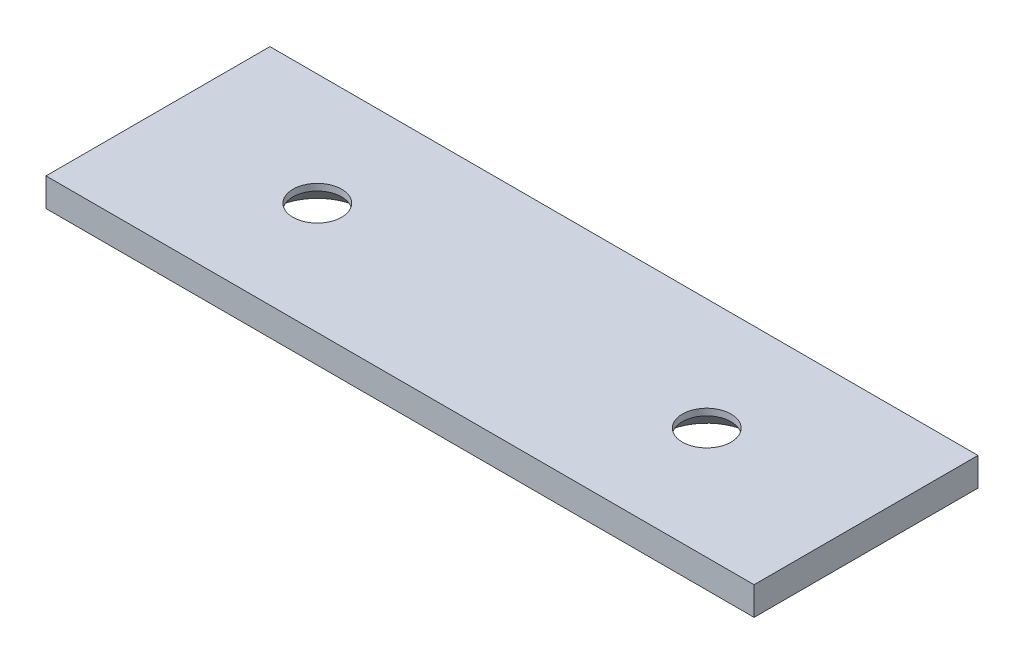
ISO-10303-21;
HEADER;
FILE_DESCRIPTION(('STEP AP214'),'2;1');
FILE_NAME('part.step','',(''),(''),'','','');
FILE_SCHEMA(('AUTOMOTIVE_DESIGN { 1 0 10303 214 1 1 1 1 }'));
ENDSEC;
DATA;
#1=APPLICATION_CONTEXT('core data for automotive mechanical design processes');
#2=APPLICATION_PROTOCOL_DEFINITION('international standard','automotive_design',2000,#1);
#3=PRODUCT_CONTEXT('',#1,'mechanical');
#4=PRODUCT('Part','Part','',(#3));
#5=PRODUCT_RELATED_PRODUCT_CATEGORY('part','',(#4));
#6=PRODUCT_DEFINITION_FORMATION('','',#4);
#7=PRODUCT_DEFINITION_CONTEXT('part definition',#1,'design');
#8=PRODUCT_DEFINITION('design','',#6,#7);
#9=PRODUCT_DEFINITION_SHAPE('','',#8);
#10=(LENGTH_UNIT() NAMED_UNIT(*) SI_UNIT(.MILLI.,.METRE.));
#11=(NAMED_UNIT(*) PLANE_ANGLE_UNIT() SI_UNIT($,.RADIAN.));
#12=(NAMED_UNIT(*) SI_UNIT($,.STERADIAN.) SOLID_ANGLE_UNIT());
#13=UNCERTAINTY_MEASURE_WITH_UNIT(LENGTH_MEASURE(1.E-05),#10,'distance_accuracy_value','');
#14=(GEOMETRIC_REPRESENTATION_CONTEXT(3) GLOBAL_UNCERTAINTY_ASSIGNED_CONTEXT((#13)) GLOBAL_UNIT_ASSIGNED_CONTEXT((#10,
#11,#12)) REPRESENTATION_CONTEXT('',''));
#15=CARTESIAN_POINT('',(0.,0.,0.));
#16=DIRECTION('',(0.,0.,1.));
#17=DIRECTION('',(1.,0.,0.));
#18=AXIS2_PLACEMENT_3D('',#15,#16,#17);
#19=CARTESIAN_POINT('',(0.,3.2,0.));
#20=DIRECTION('',(1.,0.,0.));
#21=DIRECTION('',(0.,0.,-1.));
#22=AXIS2_PLACEMENT_3D('',#19,#20,#21);
#23=PLANE('',#22);
#24=DIRECTION('',(0.,0.,1.));
#25=VECTOR('',#24,1.);
#26=CARTESIAN_POINT('',(0.,0.,0.));
#27=LINE('',#26,#25);
#28=CARTESIAN_POINT('',(0.,0.,0.));
#29=VERTEX_POINT('',#28);
#30=CARTESIAN_POINT('',(0.,0.,25.3));
#31=VERTEX_POINT('',#30);
#32=EDGE_CURVE('E99',#29,#31,#27,.T.);
#33=ORIENTED_EDGE('',*,*,#32,.T.);
#34=DIRECTION('',(0.,-1.,0.));
#35=VECTOR('',#34,1.);
#36=CARTESIAN_POINT('',(0.,3.2,25.3));
#37=LINE('',#36,#35);
#38=CARTESIAN_POINT('',(0.,3.2,25.3));
#39=VERTEX_POINT('',#38);
#40=EDGE_CURVE('E11',#39,#31,#37,.T.);
#41=ORIENTED_EDGE('',*,*,#40,.F.);
#42=DIRECTION('',(0.,0.,1.));
#43=VECTOR('',#42,1.);
#44=CARTESIAN_POINT('',(0.,3.2,0.));
#45=LINE('',#44,#43);
#46=CARTESIAN_POINT('',(0.,3.2,0.));
#47=VERTEX_POINT('',#46);
#48=EDGE_CURVE('E87',#47,#39,#45,.T.);
#49=ORIENTED_EDGE('',*,*,#48,.F.);
#50=DIRECTION('',(0.,-1.,0.));
#51=VECTOR('',#50,1.);
#52=CARTESIAN_POINT('',(0.,3.2,0.));
#53=LINE('',#52,#51);
#54=EDGE_CURVE('E95',#47,#29,#53,.T.);
#55=ORIENTED_EDGE('',*,*,#54,.T.);
#56=EDGE_LOOP('',(#33,#41,#49,#55));
#57=FACE_BOUND('',#56,.T.);
#58=ADVANCED_FACE('F36',(#57),#23,.F.);
#59=CARTESIAN_POINT('',(0.,3.2,25.3));
#60=DIRECTION('',(0.,0.,-1.));
#61=DIRECTION('',(-1.,0.,0.));
#62=AXIS2_PLACEMENT_3D('',#59,#60,#61);
#63=PLANE('',#62);
#64=DIRECTION('',(1.,0.,0.));
#65=VECTOR('',#64,1.);
#66=CARTESIAN_POINT('',(0.,0.,25.3));
#67=LINE('',#66,#65);
#68=CARTESIAN_POINT('',(80.,0.,25.3));
#69=VERTEX_POINT('',#68);
#70=EDGE_CURVE('E91',#31,#69,#67,.T.);
#71=ORIENTED_EDGE('',*,*,#70,.T.);
#72=DIRECTION('',(0.,-1.,0.));
#73=VECTOR('',#72,1.);
#74=CARTESIAN_POINT('',(80.,3.2,25.3));
#75=LINE('',#74,#73);
#76=CARTESIAN_POINT('',(80.,3.2,25.3));
#77=VERTEX_POINT('',#76);
#78=EDGE_CURVE('E44',#77,#69,#75,.T.);
#79=ORIENTED_EDGE('',*,*,#78,.F.);
#80=DIRECTION('',(1.,0.,0.));
#81=VECTOR('',#80,1.);
#82=CARTESIAN_POINT('',(0.,3.2,25.3));
#83=LINE('',#82,#81);
#84=EDGE_CURVE('E82',#39,#77,#83,.T.);
#85=ORIENTED_EDGE('',*,*,#84,.F.);
#86=ORIENTED_EDGE('',*,*,#40,.T.);
#87=EDGE_LOOP('',(#71,#79,#85,#86));
#88=FACE_BOUND('',#87,.T.);
#89=ADVANCED_FACE('F90',(#88),#63,.F.);
#90=CARTESIAN_POINT('',(80.,3.2,0.));
#91=DIRECTION('',(-1.,0.,0.));
#92=DIRECTION('',(0.,0.,1.));
#93=AXIS2_PLACEMENT_3D('',#90,#91,#92);
#94=PLANE('',#93);
#95=DIRECTION('',(0.,0.,-1.));
#96=VECTOR('',#95,1.);
#97=CARTESIAN_POINT('',(80.,0.,0.));
#98=LINE('',#97,#96);
#99=CARTESIAN_POINT('',(80.,0.,0.));
#100=VERTEX_POINT('',#99);
#101=EDGE_CURVE('E69',#69,#100,#98,.T.);
#102=ORIENTED_EDGE('',*,*,#101,.T.);
#103=DIRECTION('',(0.,-1.,0.));
#104=VECTOR('',#103,1.);
#105=CARTESIAN_POINT('',(80.,3.2,0.));
#106=LINE('',#105,#104);
#107=CARTESIAN_POINT('',(80.,3.2,0.));
#108=VERTEX_POINT('',#107);
#109=EDGE_CURVE('E92',#108,#100,#106,.T.);
#110=ORIENTED_EDGE('',*,*,#109,.F.);
#111=DIRECTION('',(0.,0.,-1.));
#112=VECTOR('',#111,1.);
#113=CARTESIAN_POINT('',(80.,3.2,0.));
#114=LINE('',#113,#112);
#115=EDGE_CURVE('E85',#77,#108,#114,.T.);
#116=ORIENTED_EDGE('',*,*,#115,.F.);
#117=ORIENTED_EDGE('',*,*,#78,.T.);
#118=EDGE_LOOP('',(#102,#110,#116,#117));
#119=FACE_BOUND('',#118,.T.);
#120=ADVANCED_FACE('F93',(#119),#94,.F.);
#121=CARTESIAN_POINT('',(0.,3.2,0.));
#122=DIRECTION('',(0.,0.,1.));
#123=DIRECTION('',(1.,0.,0.));
#124=AXIS2_PLACEMENT_3D('',#121,#122,#123);
#125=PLANE('',#124);
#126=DIRECTION('',(-1.,0.,0.));
#127=VECTOR('',#126,1.);
#128=CARTESIAN_POINT('',(0.,0.,0.));
#129=LINE('',#128,#127);
#130=EDGE_CURVE('E75',#100,#29,#129,.T.);
#131=ORIENTED_EDGE('',*,*,#130,.T.);
#132=ORIENTED_EDGE('',*,*,#54,.F.);
#133=DIRECTION('',(-1.,0.,0.));
#134=VECTOR('',#133,1.);
#135=CARTESIAN_POINT('',(0.,3.2,0.));
#136=LINE('',#135,#134);
#137=EDGE_CURVE('E52',#108,#47,#136,.T.);
#138=ORIENTED_EDGE('',*,*,#137,.F.);
#139=ORIENTED_EDGE('',*,*,#109,.T.);
#140=EDGE_LOOP('',(#131,#132,#138,#139));
#141=FACE_BOUND('',#140,.T.);
#142=ADVANCED_FACE('F107',(#141),#125,.F.);
#143=CARTESIAN_POINT('',(0.,3.2,0.));
#144=DIRECTION('',(0.,1.,0.));
#145=DIRECTION('',(0.,0.,1.));
#146=AXIS2_PLACEMENT_3D('',#143,#144,#145);
#147=PLANE('',#146);
#148=CARTESIAN_POINT('',(61.9999999999999,3.2,12.65));
#149=DIRECTION('',(0.,1.,0.));
#150=DIRECTION('',(0.,0.,1.));
#151=AXIS2_PLACEMENT_3D('',#148,#149,#150);
#152=CIRCLE('',#151,2.75);
#153=CARTESIAN_POINT('',(61.9999999999999,3.2,15.4));
#154=VERTEX_POINT('',#153);
#155=EDGE_CURVE('E121',#154,#154,#152,.T.);
#156=ORIENTED_EDGE('',*,*,#155,.F.);
#157=EDGE_LOOP('',(#156));
#158=FACE_BOUND('',#157,.T.);
#159=CARTESIAN_POINT('',(18.,3.2,12.65));
#160=DIRECTION('',(0.,1.,0.));
#161=DIRECTION('',(0.,0.,1.));
#162=AXIS2_PLACEMENT_3D('',#159,#160,#161);
#163=CIRCLE('',#162,2.75);
#164=CARTESIAN_POINT('',(18.,3.2,15.4));
#165=VERTEX_POINT('',#164);
#166=EDGE_CURVE('E102',#165,#165,#163,.T.);
#167=ORIENTED_EDGE('',*,*,#166,.F.);
#168=EDGE_LOOP('',(#167));
#169=FACE_BOUND('',#168,.T.);
#170=ORIENTED_EDGE('',*,*,#48,.T.);
#171=ORIENTED_EDGE('',*,*,#84,.T.);
#172=ORIENTED_EDGE('',*,*,#115,.T.);
#173=ORIENTED_EDGE('',*,*,#137,.T.);
#174=EDGE_LOOP('',(#170,#171,#172,#173));
#175=FACE_BOUND('',#174,.T.);
#176=ADVANCED_FACE('F83',(#158,#169,#175),#147,.T.);
#177=CARTESIAN_POINT('',(0.,0.,0.));
#178=DIRECTION('',(0.,1.,0.));
#179=DIRECTION('',(0.,0.,1.));
#180=AXIS2_PLACEMENT_3D('',#177,#178,#179);
#181=PLANE('',#180);
#182=CARTESIAN_POINT('',(61.9999999999999,0.,12.65));
#183=DIRECTION('',(0.,-1.,0.));
#184=DIRECTION('',(0.,0.,-1.));
#185=AXIS2_PLACEMENT_3D('',#182,#183,#184);
#186=CIRCLE('',#185,5.2);
#187=CARTESIAN_POINT('',(61.9999999999999,0.,7.45));
#188=VERTEX_POINT('',#187);
#189=EDGE_CURVE('E127',#188,#188,#186,.T.);
#190=ORIENTED_EDGE('',*,*,#189,.F.);
#191=EDGE_LOOP('',(#190));
#192=FACE_BOUND('',#191,.T.);
#193=CARTESIAN_POINT('',(18.,0.,12.65));
#194=DIRECTION('',(0.,-1.,0.));
#195=DIRECTION('',(0.,0.,-1.));
#196=AXIS2_PLACEMENT_3D('',#193,#194,#195);
#197=CIRCLE('',#196,5.2);
#198=CARTESIAN_POINT('',(18.,0.,7.44999999999999));
#199=VERTEX_POINT('',#198);
#200=EDGE_CURVE('E118',#199,#199,#197,.T.);
#201=ORIENTED_EDGE('',*,*,#200,.F.);
#202=EDGE_LOOP('',(#201));
#203=FACE_BOUND('',#202,.T.);
#204=ORIENTED_EDGE('',*,*,#32,.F.);
#205=ORIENTED_EDGE('',*,*,#130,.F.);
#206=ORIENTED_EDGE('',*,*,#101,.F.);
#207=ORIENTED_EDGE('',*,*,#70,.F.);
#208=EDGE_LOOP('',(#204,#205,#206,#207));
#209=FACE_BOUND('',#208,.T.);
#210=ADVANCED_FACE('F110',(#192,#203,#209),#181,.F.);
#211=CARTESIAN_POINT('',(18.,0.,12.65));
#212=DIRECTION('',(0.,-1.,0.));
#213=DIRECTION('',(0.,0.,-1.));
#214=AXIS2_PLACEMENT_3D('',#211,#212,#213);
#215=CYLINDRICAL_SURFACE('',#214,2.75);
#216=CARTESIAN_POINT('',(18.,2.45,12.65));
#217=DIRECTION('',(0.,-1.,0.));
#218=DIRECTION('',(0.,0.,-1.));
#219=AXIS2_PLACEMENT_3D('',#216,#217,#218);
#220=CIRCLE('',#219,2.75);
#221=CARTESIAN_POINT('',(18.,2.45,9.9));
#222=VERTEX_POINT('',#221);
#223=EDGE_CURVE('E115',#222,#222,#220,.T.);
#224=ORIENTED_EDGE('',*,*,#223,.T.);
#225=EDGE_LOOP('',(#224));
#226=FACE_BOUND('',#225,.T.);
#227=ORIENTED_EDGE('',*,*,#166,.T.);
#228=EDGE_LOOP('',(#227));
#229=FACE_BOUND('',#228,.T.);
#230=ADVANCED_FACE('F135',(#226,#229),#215,.F.);
#231=CARTESIAN_POINT('',(18.,0.,12.65));
#232=DIRECTION('',(0.,-1.,0.));
#233=DIRECTION('',(0.,0.,-1.));
#234=AXIS2_PLACEMENT_3D('',#231,#232,#233);
#235=CONICAL_SURFACE('',#234,5.2,0.785398163397448);
#236=ORIENTED_EDGE('',*,*,#223,.F.);
#237=EDGE_LOOP('',(#236));
#238=FACE_BOUND('',#237,.T.);
#239=ORIENTED_EDGE('',*,*,#200,.T.);
#240=EDGE_LOOP('',(#239));
#241=FACE_BOUND('',#240,.T.);
#242=ADVANCED_FACE('F139',(#238,#241),#235,.F.);
#243=CARTESIAN_POINT('',(61.9999999999999,0.,12.65));
#244=DIRECTION('',(0.,-1.,0.));
#245=DIRECTION('',(0.,0.,-1.));
#246=AXIS2_PLACEMENT_3D('',#243,#244,#245);
#247=CYLINDRICAL_SURFACE('',#246,2.75);
#248=CARTESIAN_POINT('',(61.9999999999999,2.45,12.65));
#249=DIRECTION('',(0.,-1.,0.));
#250=DIRECTION('',(0.,0.,-1.));
#251=AXIS2_PLACEMENT_3D('',#248,#249,#250);
#252=CIRCLE('',#251,2.75);
#253=CARTESIAN_POINT('',(61.9999999999999,2.45,9.89999999999999));
#254=VERTEX_POINT('',#253);
#255=EDGE_CURVE('E124',#254,#254,#252,.T.);
#256=ORIENTED_EDGE('',*,*,#255,.T.);
#257=EDGE_LOOP('',(#256));
#258=FACE_BOUND('',#257,.T.);
#259=ORIENTED_EDGE('',*,*,#155,.T.);
#260=EDGE_LOOP('',(#259));
#261=FACE_BOUND('',#260,.T.);
#262=ADVANCED_FACE('F141',(#258,#261),#247,.F.);
#263=CARTESIAN_POINT('',(61.9999999999999,0.,12.65));
#264=DIRECTION('',(0.,-1.,0.));
#265=DIRECTION('',(0.,0.,-1.));
#266=AXIS2_PLACEMENT_3D('',#263,#264,#265);
#267=CONICAL_SURFACE('',#266,5.2,0.785398163397446);
#268=ORIENTED_EDGE('',*,*,#255,.F.);
#269=EDGE_LOOP('',(#268));
#270=FACE_BOUND('',#269,.T.);
#271=ORIENTED_EDGE('',*,*,#189,.T.);
#272=EDGE_LOOP('',(#271));
#273=FACE_BOUND('',#272,.T.);
#274=ADVANCED_FACE('F131',(#270,#273),#267,.F.);
#275=CLOSED_SHELL('',(#58,#89,#120,#142,#176,#210,#230,#242,#262,#274));
#276=MANIFOLD_SOLID_BREP('B2',#275);
#277=ADVANCED_BREP_SHAPE_REPRESENTATION('',(#18,#276),#14);
#278=SHAPE_DEFINITION_REPRESENTATION(#9,#277);
ENDSEC;
END-ISO-10303-21;
